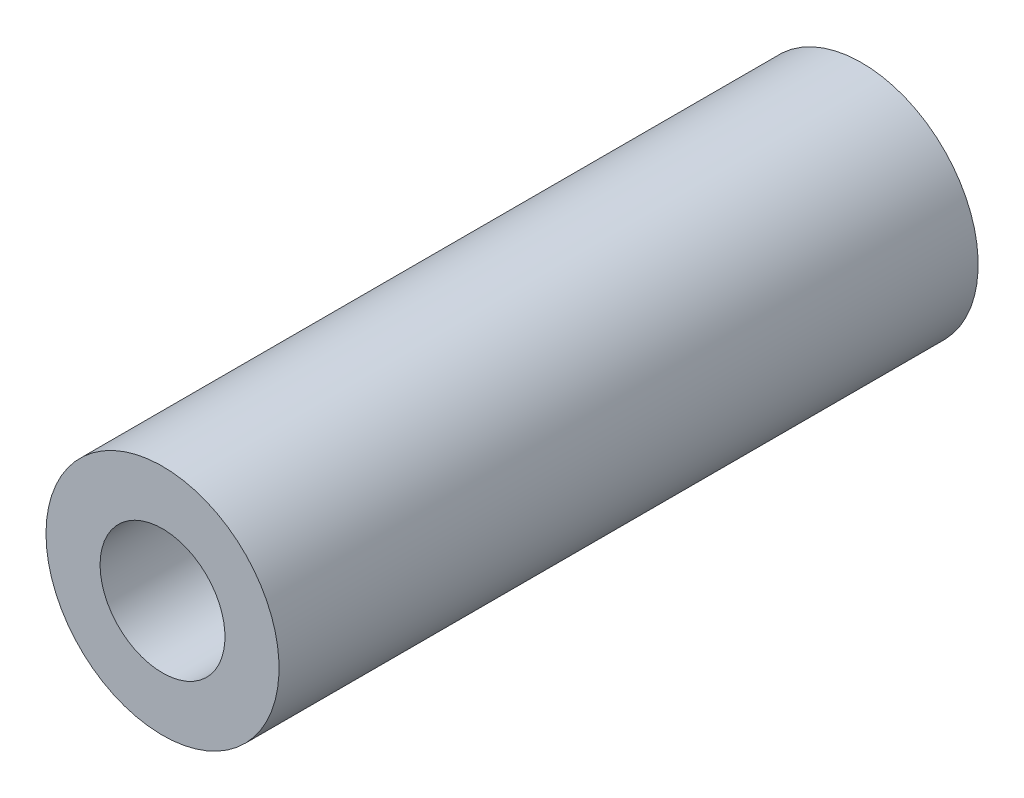
ISO-10303-21;
HEADER;
FILE_DESCRIPTION(('STEP AP214'),'2;1');
FILE_NAME('part.step','',(''),(''),'','','');
FILE_SCHEMA(('AUTOMOTIVE_DESIGN { 1 0 10303 214 1 1 1 1 }'));
ENDSEC;
DATA;
#1=APPLICATION_CONTEXT('core data for automotive mechanical design processes');
#2=APPLICATION_PROTOCOL_DEFINITION('international standard','automotive_design',2000,#1);
#3=PRODUCT_CONTEXT('',#1,'mechanical');
#4=PRODUCT('Part','Part','',(#3));
#5=PRODUCT_RELATED_PRODUCT_CATEGORY('part','',(#4));
#6=PRODUCT_DEFINITION_FORMATION('','',#4);
#7=PRODUCT_DEFINITION_CONTEXT('part definition',#1,'design');
#8=PRODUCT_DEFINITION('design','',#6,#7);
#9=PRODUCT_DEFINITION_SHAPE('','',#8);
#10=(LENGTH_UNIT() NAMED_UNIT(*) SI_UNIT(.MILLI.,.METRE.));
#11=(NAMED_UNIT(*) PLANE_ANGLE_UNIT() SI_UNIT($,.RADIAN.));
#12=(NAMED_UNIT(*) SI_UNIT($,.STERADIAN.) SOLID_ANGLE_UNIT());
#13=UNCERTAINTY_MEASURE_WITH_UNIT(LENGTH_MEASURE(1.E-05),#10,'distance_accuracy_value','');
#14=(GEOMETRIC_REPRESENTATION_CONTEXT(3) GLOBAL_UNCERTAINTY_ASSIGNED_CONTEXT((#13)) GLOBAL_UNIT_ASSIGNED_CONTEXT((#10,
#11,#12)) REPRESENTATION_CONTEXT('',''));
#15=CARTESIAN_POINT('',(0.,0.,0.));
#16=DIRECTION('',(0.,0.,1.));
#17=DIRECTION('',(1.,0.,0.));
#18=AXIS2_PLACEMENT_3D('',#15,#16,#17);
#19=CARTESIAN_POINT('',(0.,0.,14.2875));
#20=DIRECTION('',(0.,0.,-1.));
#21=DIRECTION('',(-1.,0.,0.));
#22=AXIS2_PLACEMENT_3D('',#19,#20,#21);
#23=CYLINDRICAL_SURFACE('',#22,2.5527);
#24=CARTESIAN_POINT('',(0.,0.,-14.2875));
#25=DIRECTION('',(0.,0.,-1.));
#26=DIRECTION('',(-1.,0.,0.));
#27=AXIS2_PLACEMENT_3D('',#24,#25,#26);
#28=CIRCLE('',#27,2.5527);
#29=CARTESIAN_POINT('',(-2.5527,0.,-14.2875));
#30=VERTEX_POINT('',#29);
#31=EDGE_CURVE('E26',#30,#30,#28,.T.);
#32=ORIENTED_EDGE('',*,*,#31,.T.);
#33=EDGE_LOOP('',(#32));
#34=FACE_BOUND('',#33,.T.);
#35=CARTESIAN_POINT('',(0.,0.,14.2875));
#36=DIRECTION('',(0.,0.,-1.));
#37=DIRECTION('',(-1.,0.,0.));
#38=AXIS2_PLACEMENT_3D('',#35,#36,#37);
#39=CIRCLE('',#38,2.5527);
#40=CARTESIAN_POINT('',(-2.5527,0.,14.2875));
#41=VERTEX_POINT('',#40);
#42=EDGE_CURVE('E17',#41,#41,#39,.T.);
#43=ORIENTED_EDGE('',*,*,#42,.F.);
#44=EDGE_LOOP('',(#43));
#45=FACE_BOUND('',#44,.T.);
#46=ADVANCED_FACE('F14',(#34,#45),#23,.F.);
#47=CARTESIAN_POINT('',(0.,0.,14.2875));
#48=DIRECTION('',(0.,0.,1.));
#49=DIRECTION('',(1.,0.,0.));
#50=AXIS2_PLACEMENT_3D('',#47,#48,#49);
#51=PLANE('',#50);
#52=ORIENTED_EDGE('',*,*,#42,.T.);
#53=EDGE_LOOP('',(#52));
#54=FACE_BOUND('',#53,.T.);
#55=CARTESIAN_POINT('',(0.,0.,14.2875));
#56=DIRECTION('',(0.,0.,-1.));
#57=DIRECTION('',(-1.,0.,0.));
#58=AXIS2_PLACEMENT_3D('',#55,#56,#57);
#59=CIRCLE('',#58,4.7625);
#60=CARTESIAN_POINT('',(-4.7625,0.,14.2875));
#61=VERTEX_POINT('',#60);
#62=EDGE_CURVE('E21',#61,#61,#59,.T.);
#63=ORIENTED_EDGE('',*,*,#62,.F.);
#64=EDGE_LOOP('',(#63));
#65=FACE_BOUND('',#64,.T.);
#66=ADVANCED_FACE('F34',(#54,#65),#51,.T.);
#67=CARTESIAN_POINT('',(0.,0.,-14.2875));
#68=DIRECTION('',(0.,0.,1.));
#69=DIRECTION('',(1.,0.,0.));
#70=AXIS2_PLACEMENT_3D('',#67,#68,#69);
#71=PLANE('',#70);
#72=ORIENTED_EDGE('',*,*,#31,.F.);
#73=EDGE_LOOP('',(#72));
#74=FACE_BOUND('',#73,.T.);
#75=CARTESIAN_POINT('',(0.,0.,-14.2875));
#76=DIRECTION('',(0.,0.,-1.));
#77=DIRECTION('',(-1.,0.,0.));
#78=AXIS2_PLACEMENT_3D('',#75,#76,#77);
#79=CIRCLE('',#78,4.7625);
#80=CARTESIAN_POINT('',(-4.7625,0.,-14.2875));
#81=VERTEX_POINT('',#80);
#82=EDGE_CURVE('E10',#81,#81,#79,.F.);
#83=ORIENTED_EDGE('',*,*,#82,.F.);
#84=EDGE_LOOP('',(#83));
#85=FACE_BOUND('',#84,.T.);
#86=ADVANCED_FACE('F42',(#74,#85),#71,.F.);
#87=CARTESIAN_POINT('',(0.,0.,14.2875));
#88=DIRECTION('',(0.,0.,-1.));
#89=DIRECTION('',(-1.,0.,0.));
#90=AXIS2_PLACEMENT_3D('',#87,#88,#89);
#91=CYLINDRICAL_SURFACE('',#90,4.7625);
#92=ORIENTED_EDGE('',*,*,#82,.T.);
#93=EDGE_LOOP('',(#92));
#94=FACE_BOUND('',#93,.T.);
#95=ORIENTED_EDGE('',*,*,#62,.T.);
#96=EDGE_LOOP('',(#95));
#97=FACE_BOUND('',#96,.T.);
#98=ADVANCED_FACE('F43',(#94,#97),#91,.T.);
#99=CLOSED_SHELL('',(#46,#66,#86,#98));
#100=MANIFOLD_SOLID_BREP('B1',#99);
#101=ADVANCED_BREP_SHAPE_REPRESENTATION('',(#18,#100),#14);
#102=SHAPE_DEFINITION_REPRESENTATION(#9,#101);
ENDSEC;
END-ISO-10303-21;
